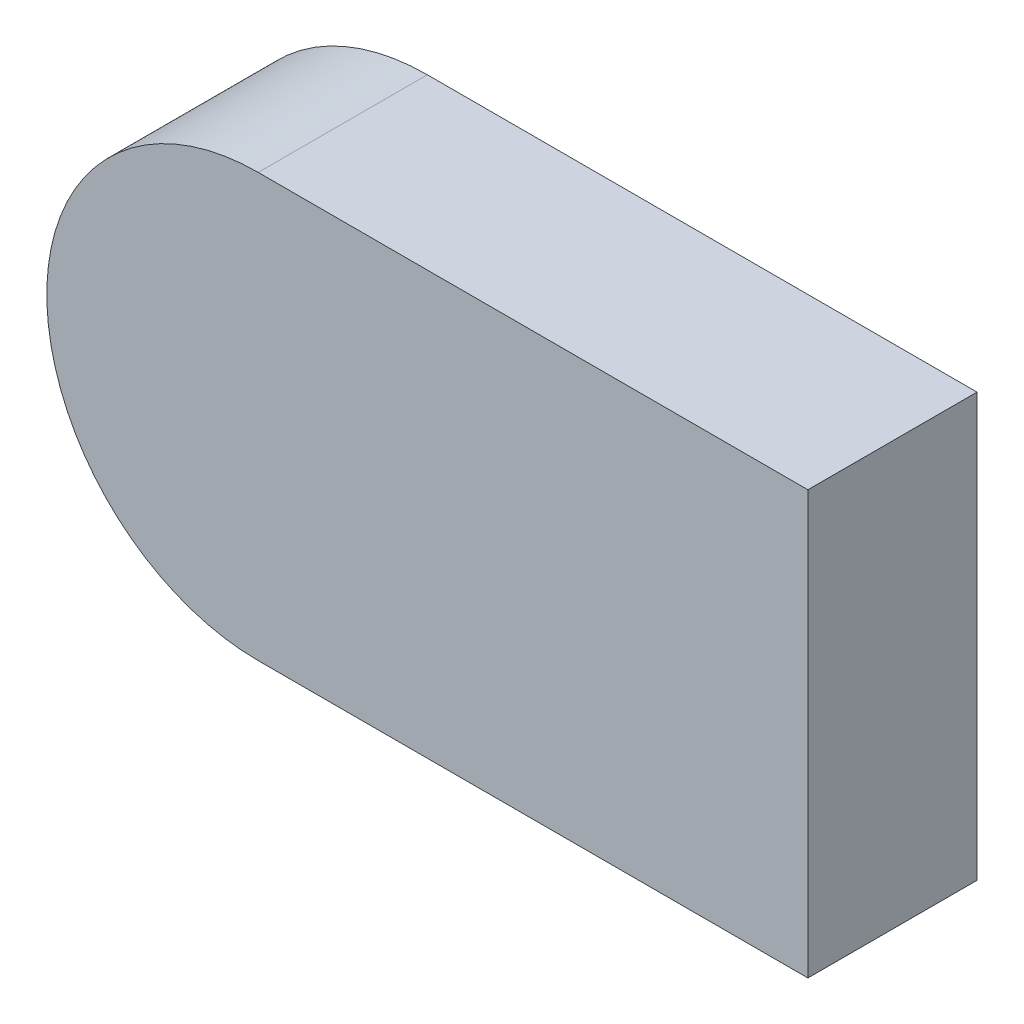
ISO-10303-21;
HEADER;
FILE_DESCRIPTION(('STEP AP214'),'2;1');
FILE_NAME('part.step','',(''),(''),'','','');
FILE_SCHEMA(('AUTOMOTIVE_DESIGN { 1 0 10303 214 1 1 1 1 }'));
ENDSEC;
DATA;
#1=APPLICATION_CONTEXT('core data for automotive mechanical design processes');
#2=APPLICATION_PROTOCOL_DEFINITION('international standard','automotive_design',2000,#1);
#3=PRODUCT_CONTEXT('',#1,'mechanical');
#4=PRODUCT('Part','Part','',(#3));
#5=PRODUCT_RELATED_PRODUCT_CATEGORY('part','',(#4));
#6=PRODUCT_DEFINITION_FORMATION('','',#4);
#7=PRODUCT_DEFINITION_CONTEXT('part definition',#1,'design');
#8=PRODUCT_DEFINITION('design','',#6,#7);
#9=PRODUCT_DEFINITION_SHAPE('','',#8);
#10=(LENGTH_UNIT() NAMED_UNIT(*) SI_UNIT(.MILLI.,.METRE.));
#11=(NAMED_UNIT(*) PLANE_ANGLE_UNIT() SI_UNIT($,.RADIAN.));
#12=(NAMED_UNIT(*) SI_UNIT($,.STERADIAN.) SOLID_ANGLE_UNIT());
#13=UNCERTAINTY_MEASURE_WITH_UNIT(LENGTH_MEASURE(1.E-05),#10,'distance_accuracy_value','');
#14=(GEOMETRIC_REPRESENTATION_CONTEXT(3) GLOBAL_UNCERTAINTY_ASSIGNED_CONTEXT((#13)) GLOBAL_UNIT_ASSIGNED_CONTEXT((#10,
#11,#12)) REPRESENTATION_CONTEXT('',''));
#15=CARTESIAN_POINT('',(0.,0.,0.));
#16=DIRECTION('',(0.,0.,1.));
#17=DIRECTION('',(1.,0.,0.));
#18=AXIS2_PLACEMENT_3D('',#15,#16,#17);
#19=CARTESIAN_POINT('',(2.05,0.625,0.));
#20=DIRECTION('',(0.,-1.,0.));
#21=DIRECTION('',(-1.,0.,0.));
#22=AXIS2_PLACEMENT_3D('',#19,#20,#21);
#23=PLANE('',#22);
#24=DIRECTION('',(0.,0.,1.));
#25=VECTOR('',#24,1.);
#26=CARTESIAN_POINT('',(2.05,0.625,0.));
#27=LINE('',#26,#25);
#28=CARTESIAN_POINT('',(2.05,0.625,0.));
#29=VERTEX_POINT('',#28);
#30=CARTESIAN_POINT('',(2.05,0.625,0.1));
#31=VERTEX_POINT('',#30);
#32=EDGE_CURVE('E11',#29,#31,#27,.T.);
#33=ORIENTED_EDGE('',*,*,#32,.T.);
#34=DIRECTION('',(-1.,0.,0.));
#35=VECTOR('',#34,1.);
#36=CARTESIAN_POINT('',(2.05,0.625,0.1));
#37=LINE('',#36,#35);
#38=CARTESIAN_POINT('',(1.725,0.625,0.1));
#39=VERTEX_POINT('',#38);
#40=EDGE_CURVE('E24',#31,#39,#37,.T.);
#41=ORIENTED_EDGE('',*,*,#40,.T.);
#42=DIRECTION('',(0.,0.,1.));
#43=VECTOR('',#42,1.);
#44=CARTESIAN_POINT('',(1.725,0.625,0.));
#45=LINE('',#44,#43);
#46=CARTESIAN_POINT('',(1.725,0.625,0.));
#47=VERTEX_POINT('',#46);
#48=EDGE_CURVE('E86',#47,#39,#45,.T.);
#49=ORIENTED_EDGE('',*,*,#48,.F.);
#50=DIRECTION('',(-1.,0.,0.));
#51=VECTOR('',#50,1.);
#52=CARTESIAN_POINT('',(2.05,0.625,0.));
#53=LINE('',#52,#51);
#54=EDGE_CURVE('E83',#29,#47,#53,.T.);
#55=ORIENTED_EDGE('',*,*,#54,.F.);
#56=EDGE_LOOP('',(#33,#41,#49,#55));
#57=FACE_BOUND('',#56,.T.);
#58=ADVANCED_FACE('F17',(#57),#23,.T.);
#59=CARTESIAN_POINT('',(1.725,0.75,0.));
#60=DIRECTION('',(0.,0.,-1.));
#61=DIRECTION('',(1.,0.,0.));
#62=AXIS2_PLACEMENT_3D('',#59,#60,#61);
#63=CYLINDRICAL_SURFACE('',#62,0.125);
#64=CARTESIAN_POINT('',(1.725,0.75,0.));
#65=DIRECTION('',(0.,0.,1.));
#66=DIRECTION('',(1.,0.,0.));
#67=AXIS2_PLACEMENT_3D('',#64,#65,#66);
#68=CIRCLE('',#67,0.125);
#69=CARTESIAN_POINT('',(1.725,0.875,0.));
#70=VERTEX_POINT('',#69);
#71=EDGE_CURVE('E80',#70,#47,#68,.T.);
#72=ORIENTED_EDGE('',*,*,#71,.T.);
#73=ORIENTED_EDGE('',*,*,#48,.T.);
#74=CARTESIAN_POINT('',(1.725,0.75,0.1));
#75=DIRECTION('',(0.,0.,1.));
#76=DIRECTION('',(1.,0.,0.));
#77=AXIS2_PLACEMENT_3D('',#74,#75,#76);
#78=CIRCLE('',#77,0.125);
#79=CARTESIAN_POINT('',(1.725,0.875,0.1));
#80=VERTEX_POINT('',#79);
#81=EDGE_CURVE('E78',#80,#39,#78,.T.);
#82=ORIENTED_EDGE('',*,*,#81,.F.);
#83=DIRECTION('',(0.,0.,1.));
#84=VECTOR('',#83,1.);
#85=CARTESIAN_POINT('',(1.725,0.875,0.));
#86=LINE('',#85,#84);
#87=EDGE_CURVE('E67',#70,#80,#86,.T.);
#88=ORIENTED_EDGE('',*,*,#87,.F.);
#89=EDGE_LOOP('',(#72,#73,#82,#88));
#90=FACE_BOUND('',#89,.T.);
#91=ADVANCED_FACE('F89',(#90),#63,.T.);
#92=CARTESIAN_POINT('',(2.05,0.875,0.));
#93=DIRECTION('',(0.,-1.,0.));
#94=DIRECTION('',(-1.,0.,0.));
#95=AXIS2_PLACEMENT_3D('',#92,#93,#94);
#96=PLANE('',#95);
#97=DIRECTION('',(-1.,0.,0.));
#98=VECTOR('',#97,1.);
#99=CARTESIAN_POINT('',(2.05,0.875,0.));
#100=LINE('',#99,#98);
#101=CARTESIAN_POINT('',(2.05,0.875,0.));
#102=VERTEX_POINT('',#101);
#103=EDGE_CURVE('E70',#102,#70,#100,.T.);
#104=ORIENTED_EDGE('',*,*,#103,.T.);
#105=ORIENTED_EDGE('',*,*,#87,.T.);
#106=DIRECTION('',(-1.,0.,0.));
#107=VECTOR('',#106,1.);
#108=CARTESIAN_POINT('',(2.05,0.875,0.1));
#109=LINE('',#108,#107);
#110=CARTESIAN_POINT('',(2.05,0.875,0.1));
#111=VERTEX_POINT('',#110);
#112=EDGE_CURVE('E61',#111,#80,#109,.T.);
#113=ORIENTED_EDGE('',*,*,#112,.F.);
#114=DIRECTION('',(0.,0.,1.));
#115=VECTOR('',#114,1.);
#116=CARTESIAN_POINT('',(2.05,0.875,0.));
#117=LINE('',#116,#115);
#118=EDGE_CURVE('E51',#102,#111,#117,.T.);
#119=ORIENTED_EDGE('',*,*,#118,.F.);
#120=EDGE_LOOP('',(#104,#105,#113,#119));
#121=FACE_BOUND('',#120,.T.);
#122=ADVANCED_FACE('F65',(#121),#96,.F.);
#123=CARTESIAN_POINT('',(2.05,0.625,0.));
#124=DIRECTION('',(-1.,0.,0.));
#125=DIRECTION('',(0.,1.,0.));
#126=AXIS2_PLACEMENT_3D('',#123,#124,#125);
#127=PLANE('',#126);
#128=DIRECTION('',(0.,1.,0.));
#129=VECTOR('',#128,1.);
#130=CARTESIAN_POINT('',(2.05,0.625,0.));
#131=LINE('',#130,#129);
#132=EDGE_CURVE('E57',#29,#102,#131,.T.);
#133=ORIENTED_EDGE('',*,*,#132,.T.);
#134=ORIENTED_EDGE('',*,*,#118,.T.);
#135=DIRECTION('',(0.,1.,0.));
#136=VECTOR('',#135,1.);
#137=CARTESIAN_POINT('',(2.05,0.625,0.1));
#138=LINE('',#137,#136);
#139=EDGE_CURVE('E55',#31,#111,#138,.T.);
#140=ORIENTED_EDGE('',*,*,#139,.F.);
#141=ORIENTED_EDGE('',*,*,#32,.F.);
#142=EDGE_LOOP('',(#133,#134,#140,#141));
#143=FACE_BOUND('',#142,.T.);
#144=ADVANCED_FACE('F53',(#143),#127,.F.);
#145=CARTESIAN_POINT('',(1.850342514613,0.75,0.));
#146=DIRECTION('',(0.,0.,-1.));
#147=DIRECTION('',(-1.,0.,0.));
#148=AXIS2_PLACEMENT_3D('',#145,#146,#147);
#149=PLANE('',#148);
#150=ORIENTED_EDGE('',*,*,#54,.T.);
#151=ORIENTED_EDGE('',*,*,#71,.F.);
#152=ORIENTED_EDGE('',*,*,#103,.F.);
#153=ORIENTED_EDGE('',*,*,#132,.F.);
#154=EDGE_LOOP('',(#150,#151,#152,#153));
#155=FACE_BOUND('',#154,.T.);
#156=ADVANCED_FACE('F91',(#155),#149,.T.);
#157=CARTESIAN_POINT('',(1.850342514613,0.75,0.1));
#158=DIRECTION('',(0.,0.,-1.));
#159=DIRECTION('',(-1.,0.,0.));
#160=AXIS2_PLACEMENT_3D('',#157,#158,#159);
#161=PLANE('',#160);
#162=ORIENTED_EDGE('',*,*,#139,.T.);
#163=ORIENTED_EDGE('',*,*,#112,.T.);
#164=ORIENTED_EDGE('',*,*,#81,.T.);
#165=ORIENTED_EDGE('',*,*,#40,.F.);
#166=EDGE_LOOP('',(#162,#163,#164,#165));
#167=FACE_BOUND('',#166,.T.);
#168=ADVANCED_FACE('F72',(#167),#161,.F.);
#169=CLOSED_SHELL('',(#58,#91,#122,#144,#156,#168));
#170=MANIFOLD_SOLID_BREP('B1',#169);
#171=ADVANCED_BREP_SHAPE_REPRESENTATION('',(#18,#170),#14);
#172=SHAPE_DEFINITION_REPRESENTATION(#9,#171);
ENDSEC;
END-ISO-10303-21;
